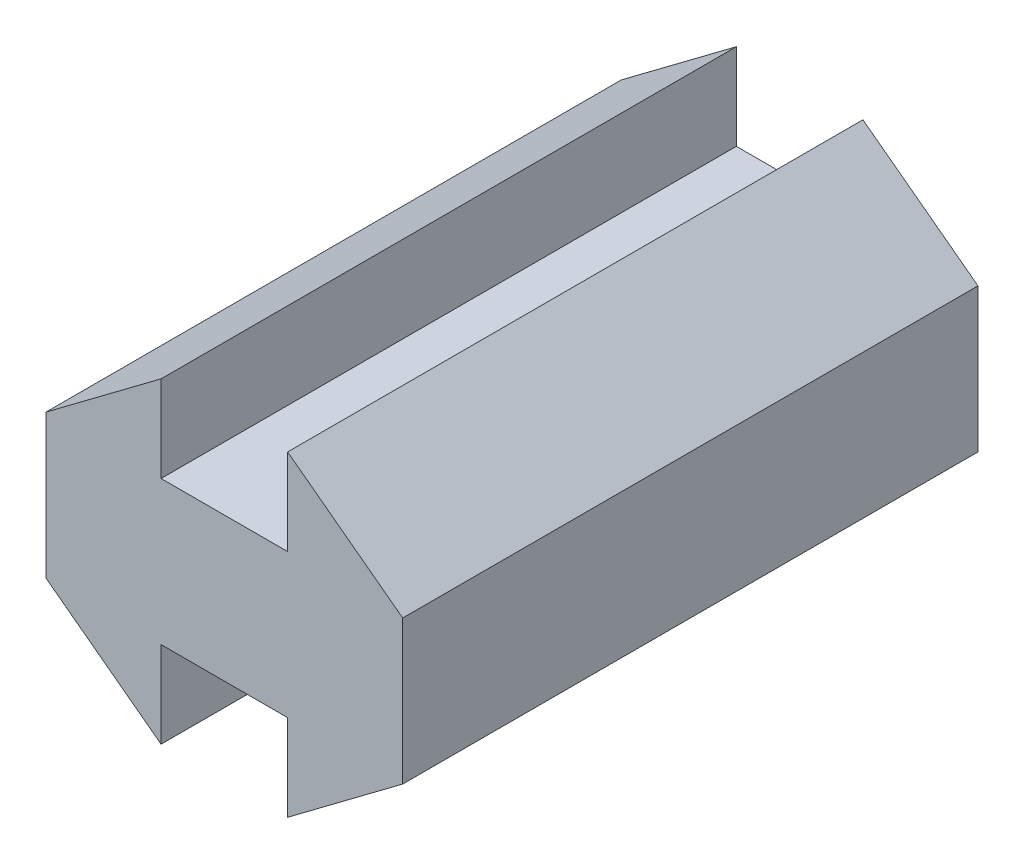
ISO-10303-21;
HEADER;
FILE_DESCRIPTION(('STEP AP214'),'2;1');
FILE_NAME('part.step','',(''),(''),'','','');
FILE_SCHEMA(('AUTOMOTIVE_DESIGN { 1 0 10303 214 1 1 1 1 }'));
ENDSEC;
DATA;
#1=APPLICATION_CONTEXT('core data for automotive mechanical design processes');
#2=APPLICATION_PROTOCOL_DEFINITION('international standard','automotive_design',2000,#1);
#3=PRODUCT_CONTEXT('',#1,'mechanical');
#4=PRODUCT('Part','Part','',(#3));
#5=PRODUCT_RELATED_PRODUCT_CATEGORY('part','',(#4));
#6=PRODUCT_DEFINITION_FORMATION('','',#4);
#7=PRODUCT_DEFINITION_CONTEXT('part definition',#1,'design');
#8=PRODUCT_DEFINITION('design','',#6,#7);
#9=PRODUCT_DEFINITION_SHAPE('','',#8);
#10=(LENGTH_UNIT() NAMED_UNIT(*) SI_UNIT(.MILLI.,.METRE.));
#11=(NAMED_UNIT(*) PLANE_ANGLE_UNIT() SI_UNIT($,.RADIAN.));
#12=(NAMED_UNIT(*) SI_UNIT($,.STERADIAN.) SOLID_ANGLE_UNIT());
#13=UNCERTAINTY_MEASURE_WITH_UNIT(LENGTH_MEASURE(1.E-05),#10,'distance_accuracy_value','');
#14=(GEOMETRIC_REPRESENTATION_CONTEXT(3) GLOBAL_UNCERTAINTY_ASSIGNED_CONTEXT((#13)) GLOBAL_UNIT_ASSIGNED_CONTEXT((#10,
#11,#12)) REPRESENTATION_CONTEXT('',''));
#15=CARTESIAN_POINT('',(0.,0.,0.));
#16=DIRECTION('',(0.,0.,1.));
#17=DIRECTION('',(1.,0.,0.));
#18=AXIS2_PLACEMENT_3D('',#15,#16,#17);
#19=CARTESIAN_POINT('',(0.,0.,20.));
#20=DIRECTION('',(0.6,0.8,0.));
#21=DIRECTION('',(-0.8,0.6,0.));
#22=AXIS2_PLACEMENT_3D('',#19,#20,#21);
#23=PLANE('',#22);
#24=DIRECTION('',(0.8,-0.6,0.));
#25=VECTOR('',#24,1.);
#26=CARTESIAN_POINT('',(0.,0.,0.));
#27=LINE('',#26,#25);
#28=CARTESIAN_POINT('',(0.,0.,0.));
#29=VERTEX_POINT('',#28);
#30=CARTESIAN_POINT('',(4.,-3.,0.));
#31=VERTEX_POINT('',#30);
#32=EDGE_CURVE('E153',#29,#31,#27,.T.);
#33=ORIENTED_EDGE('',*,*,#32,.T.);
#34=DIRECTION('',(0.,0.,-1.));
#35=VECTOR('',#34,1.);
#36=CARTESIAN_POINT('',(4.,-3.,20.));
#37=LINE('',#36,#35);
#38=CARTESIAN_POINT('',(4.,-3.,20.));
#39=VERTEX_POINT('',#38);
#40=EDGE_CURVE('E11',#39,#31,#37,.T.);
#41=ORIENTED_EDGE('',*,*,#40,.F.);
#42=DIRECTION('',(0.8,-0.6,0.));
#43=VECTOR('',#42,1.);
#44=CARTESIAN_POINT('',(0.,0.,20.));
#45=LINE('',#44,#43);
#46=CARTESIAN_POINT('',(0.,0.,20.));
#47=VERTEX_POINT('',#46);
#48=EDGE_CURVE('E175',#47,#39,#45,.T.);
#49=ORIENTED_EDGE('',*,*,#48,.F.);
#50=DIRECTION('',(0.,0.,-1.));
#51=VECTOR('',#50,1.);
#52=CARTESIAN_POINT('',(0.,0.,20.));
#53=LINE('',#52,#51);
#54=EDGE_CURVE('E149',#47,#29,#53,.T.);
#55=ORIENTED_EDGE('',*,*,#54,.T.);
#56=EDGE_LOOP('',(#33,#41,#49,#55));
#57=FACE_BOUND('',#56,.T.);
#58=ADVANCED_FACE('F33',(#57),#23,.F.);
#59=CARTESIAN_POINT('',(4.,0.,20.));
#60=DIRECTION('',(-1.,0.,0.));
#61=DIRECTION('',(0.,0.,1.));
#62=AXIS2_PLACEMENT_3D('',#59,#60,#61);
#63=PLANE('',#62);
#64=DIRECTION('',(0.,1.,0.));
#65=VECTOR('',#64,1.);
#66=CARTESIAN_POINT('',(4.,0.,0.));
#67=LINE('',#66,#65);
#68=CARTESIAN_POINT('',(4.,0.,0.));
#69=VERTEX_POINT('',#68);
#70=EDGE_CURVE('E156',#31,#69,#67,.T.);
#71=ORIENTED_EDGE('',*,*,#70,.T.);
#72=DIRECTION('',(0.,0.,-1.));
#73=VECTOR('',#72,1.);
#74=CARTESIAN_POINT('',(4.,0.,20.));
#75=LINE('',#74,#73);
#76=CARTESIAN_POINT('',(4.,0.,20.));
#77=VERTEX_POINT('',#76);
#78=EDGE_CURVE('E41',#77,#69,#75,.T.);
#79=ORIENTED_EDGE('',*,*,#78,.F.);
#80=DIRECTION('',(0.,1.,0.));
#81=VECTOR('',#80,1.);
#82=CARTESIAN_POINT('',(4.,0.,20.));
#83=LINE('',#82,#81);
#84=EDGE_CURVE('E104',#39,#77,#83,.T.);
#85=ORIENTED_EDGE('',*,*,#84,.F.);
#86=ORIENTED_EDGE('',*,*,#40,.T.);
#87=EDGE_LOOP('',(#71,#79,#85,#86));
#88=FACE_BOUND('',#87,.T.);
#89=ADVANCED_FACE('F253',(#88),#63,.F.);
#90=CARTESIAN_POINT('',(8.4,0.,20.));
#91=DIRECTION('',(0.,1.,0.));
#92=DIRECTION('',(0.,0.,1.));
#93=AXIS2_PLACEMENT_3D('',#90,#91,#92);
#94=PLANE('',#93);
#95=DIRECTION('',(1.,0.,0.));
#96=VECTOR('',#95,1.);
#97=CARTESIAN_POINT('',(8.4,0.,0.));
#98=LINE('',#97,#96);
#99=CARTESIAN_POINT('',(8.4,0.,0.));
#100=VERTEX_POINT('',#99);
#101=EDGE_CURVE('E158',#69,#100,#98,.T.);
#102=ORIENTED_EDGE('',*,*,#101,.T.);
#103=DIRECTION('',(0.,0.,-1.));
#104=VECTOR('',#103,1.);
#105=CARTESIAN_POINT('',(8.4,0.,20.));
#106=LINE('',#105,#104);
#107=CARTESIAN_POINT('',(8.4,0.,20.));
#108=VERTEX_POINT('',#107);
#109=EDGE_CURVE('E194',#108,#100,#106,.T.);
#110=ORIENTED_EDGE('',*,*,#109,.F.);
#111=DIRECTION('',(1.,0.,0.));
#112=VECTOR('',#111,1.);
#113=CARTESIAN_POINT('',(8.4,0.,20.));
#114=LINE('',#113,#112);
#115=EDGE_CURVE('E202',#77,#108,#114,.T.);
#116=ORIENTED_EDGE('',*,*,#115,.F.);
#117=ORIENTED_EDGE('',*,*,#78,.T.);
#118=EDGE_LOOP('',(#102,#110,#116,#117));
#119=FACE_BOUND('',#118,.T.);
#120=ADVANCED_FACE('F200',(#119),#94,.F.);
#121=CARTESIAN_POINT('',(8.4,0.,20.));
#122=DIRECTION('',(1.,0.,0.));
#123=DIRECTION('',(0.,0.,-1.));
#124=AXIS2_PLACEMENT_3D('',#121,#122,#123);
#125=PLANE('',#124);
#126=DIRECTION('',(0.,-1.,0.));
#127=VECTOR('',#126,1.);
#128=CARTESIAN_POINT('',(8.4,0.,0.));
#129=LINE('',#128,#127);
#130=CARTESIAN_POINT('',(8.4,-3.,0.));
#131=VERTEX_POINT('',#130);
#132=EDGE_CURVE('E160',#100,#131,#129,.T.);
#133=ORIENTED_EDGE('',*,*,#132,.T.);
#134=DIRECTION('',(0.,0.,-1.));
#135=VECTOR('',#134,1.);
#136=CARTESIAN_POINT('',(8.4,-3.,20.));
#137=LINE('',#136,#135);
#138=CARTESIAN_POINT('',(8.4,-3.,20.));
#139=VERTEX_POINT('',#138);
#140=EDGE_CURVE('E191',#139,#131,#137,.T.);
#141=ORIENTED_EDGE('',*,*,#140,.F.);
#142=DIRECTION('',(0.,-1.,0.));
#143=VECTOR('',#142,1.);
#144=CARTESIAN_POINT('',(8.4,0.,20.));
#145=LINE('',#144,#143);
#146=EDGE_CURVE('E220',#108,#139,#145,.T.);
#147=ORIENTED_EDGE('',*,*,#146,.F.);
#148=ORIENTED_EDGE('',*,*,#109,.T.);
#149=EDGE_LOOP('',(#133,#141,#147,#148));
#150=FACE_BOUND('',#149,.T.);
#151=ADVANCED_FACE('F211',(#150),#125,.F.);
#152=CARTESIAN_POINT('',(12.4,0.,20.));
#153=DIRECTION('',(-0.6,0.8,0.));
#154=DIRECTION('',(-0.8,-0.6,0.));
#155=AXIS2_PLACEMENT_3D('',#152,#153,#154);
#156=PLANE('',#155);
#157=DIRECTION('',(0.8,0.6,0.));
#158=VECTOR('',#157,1.);
#159=CARTESIAN_POINT('',(12.4,0.,0.));
#160=LINE('',#159,#158);
#161=CARTESIAN_POINT('',(12.4,0.,0.));
#162=VERTEX_POINT('',#161);
#163=EDGE_CURVE('E162',#131,#162,#160,.T.);
#164=ORIENTED_EDGE('',*,*,#163,.T.);
#165=DIRECTION('',(0.,0.,-1.));
#166=VECTOR('',#165,1.);
#167=CARTESIAN_POINT('',(12.4,0.,20.));
#168=LINE('',#167,#166);
#169=CARTESIAN_POINT('',(12.4,0.,20.));
#170=VERTEX_POINT('',#169);
#171=EDGE_CURVE('E188',#170,#162,#168,.T.);
#172=ORIENTED_EDGE('',*,*,#171,.F.);
#173=DIRECTION('',(0.8,0.6,0.));
#174=VECTOR('',#173,1.);
#175=CARTESIAN_POINT('',(12.4,0.,20.));
#176=LINE('',#175,#174);
#177=EDGE_CURVE('E217',#139,#170,#176,.T.);
#178=ORIENTED_EDGE('',*,*,#177,.F.);
#179=ORIENTED_EDGE('',*,*,#140,.T.);
#180=EDGE_LOOP('',(#164,#172,#178,#179));
#181=FACE_BOUND('',#180,.T.);
#182=ADVANCED_FACE('F215',(#181),#156,.F.);
#183=CARTESIAN_POINT('',(12.4,5.,20.));
#184=DIRECTION('',(-1.,0.,0.));
#185=DIRECTION('',(0.,0.,1.));
#186=AXIS2_PLACEMENT_3D('',#183,#184,#185);
#187=PLANE('',#186);
#188=DIRECTION('',(0.,1.,0.));
#189=VECTOR('',#188,1.);
#190=CARTESIAN_POINT('',(12.4,5.,0.));
#191=LINE('',#190,#189);
#192=CARTESIAN_POINT('',(12.4,5.,0.));
#193=VERTEX_POINT('',#192);
#194=EDGE_CURVE('E164',#162,#193,#191,.T.);
#195=ORIENTED_EDGE('',*,*,#194,.T.);
#196=DIRECTION('',(0.,0.,-1.));
#197=VECTOR('',#196,1.);
#198=CARTESIAN_POINT('',(12.4,5.,20.));
#199=LINE('',#198,#197);
#200=CARTESIAN_POINT('',(12.4,5.,20.));
#201=VERTEX_POINT('',#200);
#202=EDGE_CURVE('E185',#201,#193,#199,.T.);
#203=ORIENTED_EDGE('',*,*,#202,.F.);
#204=DIRECTION('',(0.,1.,0.));
#205=VECTOR('',#204,1.);
#206=CARTESIAN_POINT('',(12.4,5.,20.));
#207=LINE('',#206,#205);
#208=EDGE_CURVE('E219',#170,#201,#207,.T.);
#209=ORIENTED_EDGE('',*,*,#208,.F.);
#210=ORIENTED_EDGE('',*,*,#171,.T.);
#211=EDGE_LOOP('',(#195,#203,#209,#210));
#212=FACE_BOUND('',#211,.T.);
#213=ADVANCED_FACE('F266',(#212),#187,.F.);
#214=CARTESIAN_POINT('',(8.4,8.,20.));
#215=DIRECTION('',(-0.6,-0.8,0.));
#216=DIRECTION('',(0.8,-0.6,0.));
#217=AXIS2_PLACEMENT_3D('',#214,#215,#216);
#218=PLANE('',#217);
#219=DIRECTION('',(-0.8,0.6,0.));
#220=VECTOR('',#219,1.);
#221=CARTESIAN_POINT('',(8.4,8.,0.));
#222=LINE('',#221,#220);
#223=CARTESIAN_POINT('',(8.4,8.,0.));
#224=VERTEX_POINT('',#223);
#225=EDGE_CURVE('E166',#193,#224,#222,.T.);
#226=ORIENTED_EDGE('',*,*,#225,.T.);
#227=DIRECTION('',(0.,0.,-1.));
#228=VECTOR('',#227,1.);
#229=CARTESIAN_POINT('',(8.4,8.,20.));
#230=LINE('',#229,#228);
#231=CARTESIAN_POINT('',(8.4,8.,20.));
#232=VERTEX_POINT('',#231);
#233=EDGE_CURVE('E182',#232,#224,#230,.T.);
#234=ORIENTED_EDGE('',*,*,#233,.F.);
#235=DIRECTION('',(-0.8,0.6,0.));
#236=VECTOR('',#235,1.);
#237=CARTESIAN_POINT('',(8.4,8.,20.));
#238=LINE('',#237,#236);
#239=EDGE_CURVE('E222',#201,#232,#238,.T.);
#240=ORIENTED_EDGE('',*,*,#239,.F.);
#241=ORIENTED_EDGE('',*,*,#202,.T.);
#242=EDGE_LOOP('',(#226,#234,#240,#241));
#243=FACE_BOUND('',#242,.T.);
#244=ADVANCED_FACE('F269',(#243),#218,.F.);
#245=CARTESIAN_POINT('',(8.4,5.,20.));
#246=DIRECTION('',(1.,0.,0.));
#247=DIRECTION('',(0.,1.,0.));
#248=AXIS2_PLACEMENT_3D('',#245,#246,#247);
#249=PLANE('',#248);
#250=DIRECTION('',(0.,-1.,0.));
#251=VECTOR('',#250,1.);
#252=CARTESIAN_POINT('',(8.4,5.,0.));
#253=LINE('',#252,#251);
#254=CARTESIAN_POINT('',(8.4,5.,0.));
#255=VERTEX_POINT('',#254);
#256=EDGE_CURVE('E168',#224,#255,#253,.T.);
#257=ORIENTED_EDGE('',*,*,#256,.T.);
#258=DIRECTION('',(0.,0.,-1.));
#259=VECTOR('',#258,1.);
#260=CARTESIAN_POINT('',(8.4,5.,20.));
#261=LINE('',#260,#259);
#262=CARTESIAN_POINT('',(8.4,5.,20.));
#263=VERTEX_POINT('',#262);
#264=EDGE_CURVE('E179',#263,#255,#261,.T.);
#265=ORIENTED_EDGE('',*,*,#264,.F.);
#266=DIRECTION('',(0.,-1.,0.));
#267=VECTOR('',#266,1.);
#268=CARTESIAN_POINT('',(8.4,5.,20.));
#269=LINE('',#268,#267);
#270=EDGE_CURVE('E228',#232,#263,#269,.T.);
#271=ORIENTED_EDGE('',*,*,#270,.F.);
#272=ORIENTED_EDGE('',*,*,#233,.T.);
#273=EDGE_LOOP('',(#257,#265,#271,#272));
#274=FACE_BOUND('',#273,.T.);
#275=ADVANCED_FACE('F234',(#274),#249,.F.);
#276=CARTESIAN_POINT('',(4.,5.,20.));
#277=DIRECTION('',(0.,-1.,0.));
#278=DIRECTION('',(0.,0.,-1.));
#279=AXIS2_PLACEMENT_3D('',#276,#277,#278);
#280=PLANE('',#279);
#281=DIRECTION('',(-1.,0.,0.));
#282=VECTOR('',#281,1.);
#283=CARTESIAN_POINT('',(4.,5.,0.));
#284=LINE('',#283,#282);
#285=CARTESIAN_POINT('',(4.,5.,0.));
#286=VERTEX_POINT('',#285);
#287=EDGE_CURVE('E170',#255,#286,#284,.T.);
#288=ORIENTED_EDGE('',*,*,#287,.T.);
#289=DIRECTION('',(0.,0.,-1.));
#290=VECTOR('',#289,1.);
#291=CARTESIAN_POINT('',(4.,5.,20.));
#292=LINE('',#291,#290);
#293=CARTESIAN_POINT('',(4.,5.,20.));
#294=VERTEX_POINT('',#293);
#295=EDGE_CURVE('E144',#294,#286,#292,.T.);
#296=ORIENTED_EDGE('',*,*,#295,.F.);
#297=DIRECTION('',(-1.,0.,0.));
#298=VECTOR('',#297,1.);
#299=CARTESIAN_POINT('',(4.,5.,20.));
#300=LINE('',#299,#298);
#301=EDGE_CURVE('E135',#263,#294,#300,.T.);
#302=ORIENTED_EDGE('',*,*,#301,.F.);
#303=ORIENTED_EDGE('',*,*,#264,.T.);
#304=EDGE_LOOP('',(#288,#296,#302,#303));
#305=FACE_BOUND('',#304,.T.);
#306=ADVANCED_FACE('F238',(#305),#280,.F.);
#307=CARTESIAN_POINT('',(4.,8.,20.));
#308=DIRECTION('',(-1.,0.,0.));
#309=DIRECTION('',(0.,0.,1.));
#310=AXIS2_PLACEMENT_3D('',#307,#308,#309);
#311=PLANE('',#310);
#312=DIRECTION('',(0.,1.,0.));
#313=VECTOR('',#312,1.);
#314=CARTESIAN_POINT('',(4.,8.,0.));
#315=LINE('',#314,#313);
#316=CARTESIAN_POINT('',(4.,8.,0.));
#317=VERTEX_POINT('',#316);
#318=EDGE_CURVE('E143',#286,#317,#315,.T.);
#319=ORIENTED_EDGE('',*,*,#318,.T.);
#320=DIRECTION('',(0.,0.,-1.));
#321=VECTOR('',#320,1.);
#322=CARTESIAN_POINT('',(4.,8.,20.));
#323=LINE('',#322,#321);
#324=CARTESIAN_POINT('',(4.,8.,20.));
#325=VERTEX_POINT('',#324);
#326=EDGE_CURVE('E140',#325,#317,#323,.T.);
#327=ORIENTED_EDGE('',*,*,#326,.F.);
#328=DIRECTION('',(0.,1.,0.));
#329=VECTOR('',#328,1.);
#330=CARTESIAN_POINT('',(4.,8.,20.));
#331=LINE('',#330,#329);
#332=EDGE_CURVE('E129',#294,#325,#331,.T.);
#333=ORIENTED_EDGE('',*,*,#332,.F.);
#334=ORIENTED_EDGE('',*,*,#295,.T.);
#335=EDGE_LOOP('',(#319,#327,#333,#334));
#336=FACE_BOUND('',#335,.T.);
#337=ADVANCED_FACE('F141',(#336),#311,.F.);
#338=CARTESIAN_POINT('',(0.,5.,20.));
#339=DIRECTION('',(0.6,-0.8,0.));
#340=DIRECTION('',(0.8,0.6,0.));
#341=AXIS2_PLACEMENT_3D('',#338,#339,#340);
#342=PLANE('',#341);
#343=DIRECTION('',(-0.8,-0.6,0.));
#344=VECTOR('',#343,1.);
#345=CARTESIAN_POINT('',(0.,5.,0.));
#346=LINE('',#345,#344);
#347=CARTESIAN_POINT('',(0.,5.,0.));
#348=VERTEX_POINT('',#347);
#349=EDGE_CURVE('E90',#317,#348,#346,.T.);
#350=ORIENTED_EDGE('',*,*,#349,.T.);
#351=DIRECTION('',(0.,0.,-1.));
#352=VECTOR('',#351,1.);
#353=CARTESIAN_POINT('',(0.,5.,20.));
#354=LINE('',#353,#352);
#355=CARTESIAN_POINT('',(0.,5.,20.));
#356=VERTEX_POINT('',#355);
#357=EDGE_CURVE('E145',#356,#348,#354,.T.);
#358=ORIENTED_EDGE('',*,*,#357,.F.);
#359=DIRECTION('',(-0.8,-0.6,0.));
#360=VECTOR('',#359,1.);
#361=CARTESIAN_POINT('',(0.,5.,20.));
#362=LINE('',#361,#360);
#363=EDGE_CURVE('E133',#325,#356,#362,.T.);
#364=ORIENTED_EDGE('',*,*,#363,.F.);
#365=ORIENTED_EDGE('',*,*,#326,.T.);
#366=EDGE_LOOP('',(#350,#358,#364,#365));
#367=FACE_BOUND('',#366,.T.);
#368=ADVANCED_FACE('F147',(#367),#342,.F.);
#369=CARTESIAN_POINT('',(0.,0.,20.));
#370=DIRECTION('',(1.,0.,0.));
#371=DIRECTION('',(0.,0.,-1.));
#372=AXIS2_PLACEMENT_3D('',#369,#370,#371);
#373=PLANE('',#372);
#374=DIRECTION('',(0.,-1.,0.));
#375=VECTOR('',#374,1.);
#376=CARTESIAN_POINT('',(0.,0.,0.));
#377=LINE('',#376,#375);
#378=EDGE_CURVE('E96',#348,#29,#377,.T.);
#379=ORIENTED_EDGE('',*,*,#378,.T.);
#380=ORIENTED_EDGE('',*,*,#54,.F.);
#381=DIRECTION('',(0.,-1.,0.));
#382=VECTOR('',#381,1.);
#383=CARTESIAN_POINT('',(0.,0.,20.));
#384=LINE('',#383,#382);
#385=EDGE_CURVE('E49',#356,#47,#384,.T.);
#386=ORIENTED_EDGE('',*,*,#385,.F.);
#387=ORIENTED_EDGE('',*,*,#357,.T.);
#388=EDGE_LOOP('',(#379,#380,#386,#387));
#389=FACE_BOUND('',#388,.T.);
#390=ADVANCED_FACE('F242',(#389),#373,.F.);
#391=CARTESIAN_POINT('',(0.,0.,20.));
#392=DIRECTION('',(0.,0.,-1.));
#393=DIRECTION('',(-1.,0.,0.));
#394=AXIS2_PLACEMENT_3D('',#391,#392,#393);
#395=PLANE('',#394);
#396=ORIENTED_EDGE('',*,*,#48,.T.);
#397=ORIENTED_EDGE('',*,*,#84,.T.);
#398=ORIENTED_EDGE('',*,*,#115,.T.);
#399=ORIENTED_EDGE('',*,*,#146,.T.);
#400=ORIENTED_EDGE('',*,*,#177,.T.);
#401=ORIENTED_EDGE('',*,*,#208,.T.);
#402=ORIENTED_EDGE('',*,*,#239,.T.);
#403=ORIENTED_EDGE('',*,*,#270,.T.);
#404=ORIENTED_EDGE('',*,*,#301,.T.);
#405=ORIENTED_EDGE('',*,*,#332,.T.);
#406=ORIENTED_EDGE('',*,*,#363,.T.);
#407=ORIENTED_EDGE('',*,*,#385,.T.);
#408=EDGE_LOOP('',(#396,#397,#398,#399,#400,#401,#402,#403,#404,#405,#406,#407));
#409=FACE_BOUND('',#408,.T.);
#410=ADVANCED_FACE('F131',(#409),#395,.F.);
#411=CARTESIAN_POINT('',(0.,0.,0.));
#412=DIRECTION('',(0.,0.,-1.));
#413=DIRECTION('',(-1.,0.,0.));
#414=AXIS2_PLACEMENT_3D('',#411,#412,#413);
#415=PLANE('',#414);
#416=ORIENTED_EDGE('',*,*,#32,.F.);
#417=ORIENTED_EDGE('',*,*,#378,.F.);
#418=ORIENTED_EDGE('',*,*,#349,.F.);
#419=ORIENTED_EDGE('',*,*,#318,.F.);
#420=ORIENTED_EDGE('',*,*,#287,.F.);
#421=ORIENTED_EDGE('',*,*,#256,.F.);
#422=ORIENTED_EDGE('',*,*,#225,.F.);
#423=ORIENTED_EDGE('',*,*,#194,.F.);
#424=ORIENTED_EDGE('',*,*,#163,.F.);
#425=ORIENTED_EDGE('',*,*,#132,.F.);
#426=ORIENTED_EDGE('',*,*,#101,.F.);
#427=ORIENTED_EDGE('',*,*,#70,.F.);
#428=EDGE_LOOP('',(#416,#417,#418,#419,#420,#421,#422,#423,#424,#425,#426,#427));
#429=FACE_BOUND('',#428,.T.);
#430=ADVANCED_FACE('F206',(#429),#415,.T.);
#431=CLOSED_SHELL('',(#58,#89,#120,#151,#182,#213,#244,#275,#306,#337,#368,#390,#410,#430));
#432=MANIFOLD_SOLID_BREP('B2',#431);
#433=ADVANCED_BREP_SHAPE_REPRESENTATION('',(#18,#432),#14);
#434=SHAPE_DEFINITION_REPRESENTATION(#9,#433);
ENDSEC;
END-ISO-10303-21;
